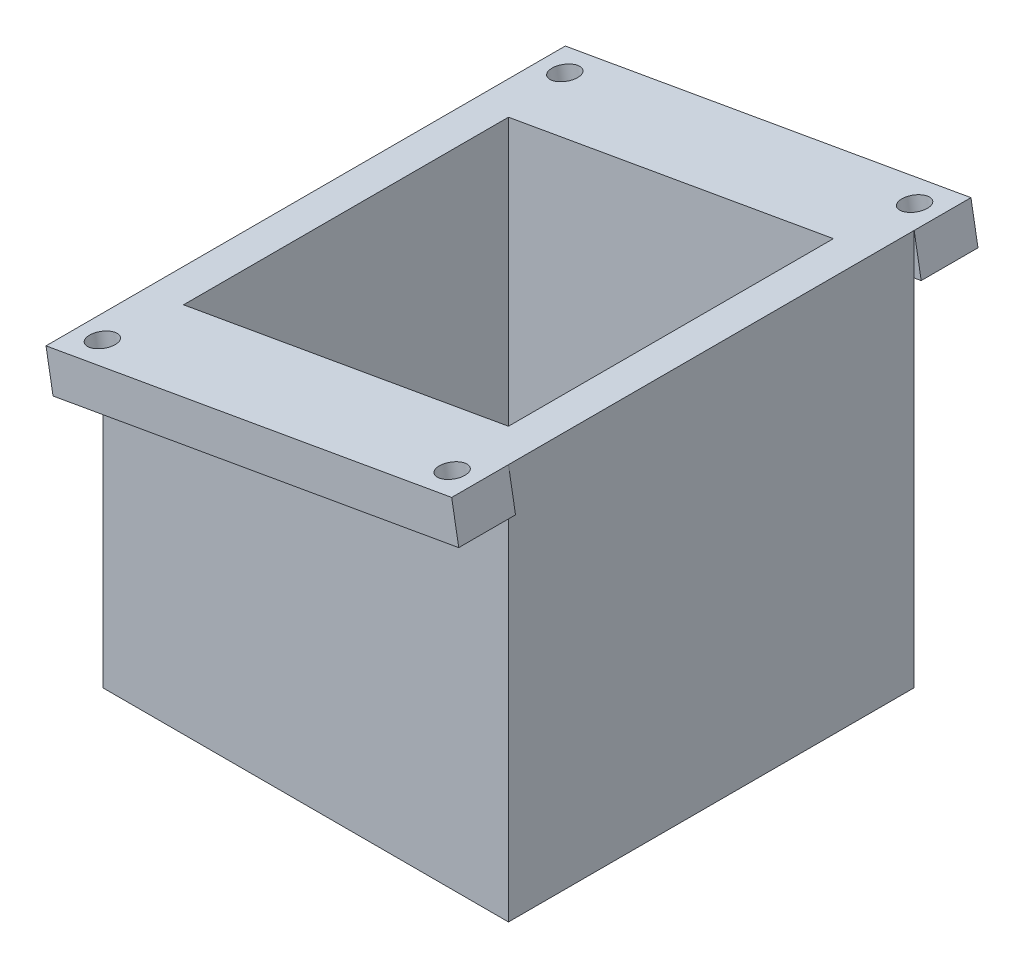
ISO-10303-21;
HEADER;
FILE_DESCRIPTION(('STEP AP214'),'2;1');
FILE_NAME('part.step','',(''),(''),'','','');
FILE_SCHEMA(('AUTOMOTIVE_DESIGN { 1 0 10303 214 1 1 1 1 }'));
ENDSEC;
DATA;
#1=APPLICATION_CONTEXT('core data for automotive mechanical design processes');
#2=APPLICATION_PROTOCOL_DEFINITION('international standard','automotive_design',2000,#1);
#3=PRODUCT_CONTEXT('',#1,'mechanical');
#4=PRODUCT('Part','Part','',(#3));
#5=PRODUCT_RELATED_PRODUCT_CATEGORY('part','',(#4));
#6=PRODUCT_DEFINITION_FORMATION('','',#4);
#7=PRODUCT_DEFINITION_CONTEXT('part definition',#1,'design');
#8=PRODUCT_DEFINITION('design','',#6,#7);
#9=PRODUCT_DEFINITION_SHAPE('','',#8);
#10=(LENGTH_UNIT() NAMED_UNIT(*) SI_UNIT(.MILLI.,.METRE.));
#11=(NAMED_UNIT(*) PLANE_ANGLE_UNIT() SI_UNIT($,.RADIAN.));
#12=(NAMED_UNIT(*) SI_UNIT($,.STERADIAN.) SOLID_ANGLE_UNIT());
#13=UNCERTAINTY_MEASURE_WITH_UNIT(LENGTH_MEASURE(1.E-05),#10,'distance_accuracy_value','');
#14=(GEOMETRIC_REPRESENTATION_CONTEXT(3) GLOBAL_UNCERTAINTY_ASSIGNED_CONTEXT((#13)) GLOBAL_UNIT_ASSIGNED_CONTEXT((#10,
#11,#12)) REPRESENTATION_CONTEXT('',''));
#15=CARTESIAN_POINT('',(0.,0.,0.));
#16=DIRECTION('',(0.,0.,1.));
#17=DIRECTION('',(1.,0.,0.));
#18=AXIS2_PLACEMENT_3D('',#15,#16,#17);
#19=CARTESIAN_POINT('',(25.,5.,-25.));
#20=DIRECTION('',(0.,0.,1.));
#21=DIRECTION('',(1.,0.,0.));
#22=AXIS2_PLACEMENT_3D('',#19,#20,#21);
#23=PLANE('',#22);
#24=DIRECTION('',(-0.17364819609251,0.984807749763281,0.));
#25=VECTOR('',#24,1.);
#26=CARTESIAN_POINT('',(-24.1317590195375,35.0759612511836,-25.));
#27=LINE('',#26,#25);
#28=CARTESIAN_POINT('',(-24.1317590195375,35.0759612511836,-25.));
#29=VERTEX_POINT('',#28);
#30=CARTESIAN_POINT('',(-25.,40.,-25.));
#31=VERTEX_POINT('',#30);
#32=EDGE_CURVE('E301',#29,#31,#27,.T.);
#33=ORIENTED_EDGE('',*,*,#32,.F.);
#34=DIRECTION('',(0.984807749763281,0.17364819609251,0.));
#35=VECTOR('',#34,1.);
#36=CARTESIAN_POINT('',(-24.1317590195375,35.0759612511836,-25.));
#37=LINE('',#36,#35);
#38=CARTESIAN_POINT('',(25.,43.7392169238216,-25.));
#39=VERTEX_POINT('',#38);
#40=EDGE_CURVE('E292',#29,#39,#37,.T.);
#41=ORIENTED_EDGE('',*,*,#40,.T.);
#42=DIRECTION('',(0.,-1.,0.));
#43=VECTOR('',#42,1.);
#44=CARTESIAN_POINT('',(25.,5.,-25.));
#45=LINE('',#44,#43);
#46=CARTESIAN_POINT('',(25.,0.,-25.));
#47=VERTEX_POINT('',#46);
#48=EDGE_CURVE('E285',#39,#47,#45,.T.);
#49=ORIENTED_EDGE('',*,*,#48,.T.);
#50=DIRECTION('',(-1.,0.,0.));
#51=VECTOR('',#50,1.);
#52=CARTESIAN_POINT('',(25.,0.,-25.));
#53=LINE('',#52,#51);
#54=CARTESIAN_POINT('',(-25.,0.,-25.));
#55=VERTEX_POINT('',#54);
#56=EDGE_CURVE('E280',#47,#55,#53,.T.);
#57=ORIENTED_EDGE('',*,*,#56,.T.);
#58=DIRECTION('',(0.,-1.,0.));
#59=VECTOR('',#58,1.);
#60=CARTESIAN_POINT('',(-25.,5.,-25.));
#61=LINE('',#60,#59);
#62=EDGE_CURVE('E282',#31,#55,#61,.T.);
#63=ORIENTED_EDGE('',*,*,#62,.F.);
#64=EDGE_LOOP('',(#33,#41,#49,#57,#63));
#65=FACE_BOUND('',#64,.T.);
#66=ADVANCED_FACE('F39',(#65),#23,.F.);
#67=CARTESIAN_POINT('',(0.,5.,0.));
#68=DIRECTION('',(0.,-1.,0.));
#69=DIRECTION('',(0.,0.,-1.));
#70=AXIS2_PLACEMENT_3D('',#67,#68,#69);
#71=PLANE('',#70);
#72=DIRECTION('',(0.,0.,-1.));
#73=VECTOR('',#72,1.);
#74=CARTESIAN_POINT('',(20.025,5.,0.));
#75=LINE('',#74,#73);
#76=CARTESIAN_POINT('',(20.025,5.,20.025));
#77=VERTEX_POINT('',#76);
#78=CARTESIAN_POINT('',(20.025,5.,-20.025));
#79=VERTEX_POINT('',#78);
#80=EDGE_CURVE('E235',#77,#79,#75,.T.);
#81=ORIENTED_EDGE('',*,*,#80,.T.);
#82=DIRECTION('',(-1.,0.,0.));
#83=VECTOR('',#82,1.);
#84=CARTESIAN_POINT('',(0.,5.,-20.025));
#85=LINE('',#84,#83);
#86=CARTESIAN_POINT('',(-20.025,5.,-20.025));
#87=VERTEX_POINT('',#86);
#88=EDGE_CURVE('E238',#79,#87,#85,.T.);
#89=ORIENTED_EDGE('',*,*,#88,.T.);
#90=DIRECTION('',(0.,0.,1.));
#91=VECTOR('',#90,1.);
#92=CARTESIAN_POINT('',(-20.025,5.,0.));
#93=LINE('',#92,#91);
#94=CARTESIAN_POINT('',(-20.025,5.,20.025));
#95=VERTEX_POINT('',#94);
#96=EDGE_CURVE('E229',#87,#95,#93,.T.);
#97=ORIENTED_EDGE('',*,*,#96,.T.);
#98=DIRECTION('',(1.,0.,0.));
#99=VECTOR('',#98,1.);
#100=CARTESIAN_POINT('',(0.,5.,20.025));
#101=LINE('',#100,#99);
#102=EDGE_CURVE('E232',#95,#77,#101,.T.);
#103=ORIENTED_EDGE('',*,*,#102,.T.);
#104=EDGE_LOOP('',(#81,#89,#97,#103));
#105=FACE_BOUND('',#104,.T.);
#106=DIRECTION('',(0.,0.,1.));
#107=VECTOR('',#106,1.);
#108=CARTESIAN_POINT('',(-18.025,5.,-18.025));
#109=LINE('',#108,#107);
#110=CARTESIAN_POINT('',(-18.025,5.,-18.025));
#111=VERTEX_POINT('',#110);
#112=CARTESIAN_POINT('',(-18.025,5.,18.025));
#113=VERTEX_POINT('',#112);
#114=EDGE_CURVE('E242',#111,#113,#109,.T.);
#115=ORIENTED_EDGE('',*,*,#114,.F.);
#116=DIRECTION('',(-1.,0.,0.));
#117=VECTOR('',#116,1.);
#118=CARTESIAN_POINT('',(18.025,5.,-18.025));
#119=LINE('',#118,#117);
#120=CARTESIAN_POINT('',(18.025,5.,-18.025));
#121=VERTEX_POINT('',#120);
#122=EDGE_CURVE('E250',#121,#111,#119,.T.);
#123=ORIENTED_EDGE('',*,*,#122,.F.);
#124=DIRECTION('',(0.,0.,-1.));
#125=VECTOR('',#124,1.);
#126=CARTESIAN_POINT('',(18.025,5.,-18.025));
#127=LINE('',#126,#125);
#128=CARTESIAN_POINT('',(18.025,5.,18.025));
#129=VERTEX_POINT('',#128);
#130=EDGE_CURVE('E247',#129,#121,#127,.T.);
#131=ORIENTED_EDGE('',*,*,#130,.F.);
#132=DIRECTION('',(1.,0.,0.));
#133=VECTOR('',#132,1.);
#134=CARTESIAN_POINT('',(18.025,5.,18.025));
#135=LINE('',#134,#133);
#136=EDGE_CURVE('E244',#113,#129,#135,.T.);
#137=ORIENTED_EDGE('',*,*,#136,.F.);
#138=EDGE_LOOP('',(#115,#123,#131,#137));
#139=FACE_BOUND('',#138,.T.);
#140=ADVANCED_FACE('F332',(#105,#139),#71,.F.);
#141=CARTESIAN_POINT('',(0.,0.,0.));
#142=DIRECTION('',(0.,-1.,0.));
#143=DIRECTION('',(0.,0.,-1.));
#144=AXIS2_PLACEMENT_3D('',#141,#142,#143);
#145=PLANE('',#144);
#146=DIRECTION('',(-1.,0.,0.));
#147=VECTOR('',#146,1.);
#148=CARTESIAN_POINT('',(18.025,0.,-18.025));
#149=LINE('',#148,#147);
#150=CARTESIAN_POINT('',(18.025,0.,-18.025));
#151=VERTEX_POINT('',#150);
#152=CARTESIAN_POINT('',(-18.025,0.,-18.025));
#153=VERTEX_POINT('',#152);
#154=EDGE_CURVE('E245',#151,#153,#149,.T.);
#155=ORIENTED_EDGE('',*,*,#154,.T.);
#156=DIRECTION('',(0.,0.,1.));
#157=VECTOR('',#156,1.);
#158=CARTESIAN_POINT('',(-18.025,0.,-18.025));
#159=LINE('',#158,#157);
#160=CARTESIAN_POINT('',(-18.025,0.,18.025));
#161=VERTEX_POINT('',#160);
#162=EDGE_CURVE('E241',#153,#161,#159,.T.);
#163=ORIENTED_EDGE('',*,*,#162,.T.);
#164=DIRECTION('',(1.,0.,0.));
#165=VECTOR('',#164,1.);
#166=CARTESIAN_POINT('',(18.025,0.,18.025));
#167=LINE('',#166,#165);
#168=CARTESIAN_POINT('',(18.025,0.,18.025));
#169=VERTEX_POINT('',#168);
#170=EDGE_CURVE('E255',#161,#169,#167,.T.);
#171=ORIENTED_EDGE('',*,*,#170,.T.);
#172=DIRECTION('',(0.,0.,-1.));
#173=VECTOR('',#172,1.);
#174=CARTESIAN_POINT('',(18.025,0.,-18.025));
#175=LINE('',#174,#173);
#176=EDGE_CURVE('E258',#169,#151,#175,.T.);
#177=ORIENTED_EDGE('',*,*,#176,.T.);
#178=EDGE_LOOP('',(#155,#163,#171,#177));
#179=FACE_BOUND('',#178,.T.);
#180=DIRECTION('',(0.,0.,1.));
#181=VECTOR('',#180,1.);
#182=CARTESIAN_POINT('',(-25.,0.,-25.));
#183=LINE('',#182,#181);
#184=CARTESIAN_POINT('',(-25.,0.,25.));
#185=VERTEX_POINT('',#184);
#186=EDGE_CURVE('E272',#55,#185,#183,.T.);
#187=ORIENTED_EDGE('',*,*,#186,.F.);
#188=ORIENTED_EDGE('',*,*,#56,.F.);
#189=DIRECTION('',(0.,0.,-1.));
#190=VECTOR('',#189,1.);
#191=CARTESIAN_POINT('',(25.,0.,-25.));
#192=LINE('',#191,#190);
#193=CARTESIAN_POINT('',(25.,0.,25.));
#194=VERTEX_POINT('',#193);
#195=EDGE_CURVE('E278',#194,#47,#192,.T.);
#196=ORIENTED_EDGE('',*,*,#195,.F.);
#197=DIRECTION('',(1.,0.,0.));
#198=VECTOR('',#197,1.);
#199=CARTESIAN_POINT('',(25.,0.,25.));
#200=LINE('',#199,#198);
#201=EDGE_CURVE('E275',#185,#194,#200,.T.);
#202=ORIENTED_EDGE('',*,*,#201,.F.);
#203=EDGE_LOOP('',(#187,#188,#196,#202));
#204=FACE_BOUND('',#203,.T.);
#205=ADVANCED_FACE('F296',(#179,#204),#145,.T.);
#206=CARTESIAN_POINT('',(-25.,5.,-25.));
#207=DIRECTION('',(1.,0.,0.));
#208=DIRECTION('',(0.,0.,-1.));
#209=AXIS2_PLACEMENT_3D('',#206,#207,#208);
#210=PLANE('',#209);
#211=ORIENTED_EDGE('',*,*,#186,.T.);
#212=DIRECTION('',(0.,-1.,0.));
#213=VECTOR('',#212,1.);
#214=CARTESIAN_POINT('',(-25.,5.,25.));
#215=LINE('',#214,#213);
#216=CARTESIAN_POINT('',(-25.,40.,25.));
#217=VERTEX_POINT('',#216);
#218=EDGE_CURVE('E43',#217,#185,#215,.T.);
#219=ORIENTED_EDGE('',*,*,#218,.F.);
#220=DIRECTION('',(0.,0.,1.));
#221=VECTOR('',#220,1.);
#222=CARTESIAN_POINT('',(-25.,40.,25.));
#223=LINE('',#222,#221);
#224=EDGE_CURVE('E211',#31,#217,#223,.T.);
#225=ORIENTED_EDGE('',*,*,#224,.F.);
#226=ORIENTED_EDGE('',*,*,#62,.T.);
#227=EDGE_LOOP('',(#211,#219,#225,#226));
#228=FACE_BOUND('',#227,.T.);
#229=ADVANCED_FACE('F41',(#228),#210,.F.);
#230=CARTESIAN_POINT('',(25.,5.,25.));
#231=DIRECTION('',(0.,0.,-1.));
#232=DIRECTION('',(-1.,0.,0.));
#233=AXIS2_PLACEMENT_3D('',#230,#231,#232);
#234=PLANE('',#233);
#235=DIRECTION('',(0.,-1.,0.));
#236=VECTOR('',#235,1.);
#237=CARTESIAN_POINT('',(25.,5.,25.));
#238=LINE('',#237,#236);
#239=CARTESIAN_POINT('',(25.,43.7392169238216,25.));
#240=VERTEX_POINT('',#239);
#241=EDGE_CURVE('E180',#240,#194,#238,.T.);
#242=ORIENTED_EDGE('',*,*,#241,.F.);
#243=DIRECTION('',(-0.984807749763281,-0.17364819609251,0.));
#244=VECTOR('',#243,1.);
#245=CARTESIAN_POINT('',(-24.1317590195375,35.0759612511836,25.));
#246=LINE('',#245,#244);
#247=CARTESIAN_POINT('',(-24.1317590195375,35.0759612511836,25.));
#248=VERTEX_POINT('',#247);
#249=EDGE_CURVE('E11',#240,#248,#246,.T.);
#250=ORIENTED_EDGE('',*,*,#249,.T.);
#251=DIRECTION('',(-0.17364819609251,0.984807749763281,0.));
#252=VECTOR('',#251,1.);
#253=CARTESIAN_POINT('',(-24.1317590195375,35.0759612511836,25.));
#254=LINE('',#253,#252);
#255=EDGE_CURVE('E362',#248,#217,#254,.T.);
#256=ORIENTED_EDGE('',*,*,#255,.T.);
#257=ORIENTED_EDGE('',*,*,#218,.T.);
#258=ORIENTED_EDGE('',*,*,#201,.T.);
#259=EDGE_LOOP('',(#242,#250,#256,#257,#258));
#260=FACE_BOUND('',#259,.T.);
#261=ADVANCED_FACE('F355',(#260),#234,.F.);
#262=CARTESIAN_POINT('',(25.,5.,-25.));
#263=DIRECTION('',(-1.,0.,0.));
#264=DIRECTION('',(0.,0.,1.));
#265=AXIS2_PLACEMENT_3D('',#262,#263,#264);
#266=PLANE('',#265);
#267=ORIENTED_EDGE('',*,*,#195,.T.);
#268=ORIENTED_EDGE('',*,*,#48,.F.);
#269=CARTESIAN_POINT('',(25.,48.81635,-25.));
#270=VERTEX_POINT('',#269);
#271=EDGE_CURVE('E206',#270,#39,#45,.T.);
#272=ORIENTED_EDGE('',*,*,#271,.F.);
#273=DIRECTION('',(0.,0.,-1.));
#274=VECTOR('',#273,1.);
#275=CARTESIAN_POINT('',(25.,48.81635,25.));
#276=LINE('',#275,#274);
#277=CARTESIAN_POINT('',(25.,48.81635,25.));
#278=VERTEX_POINT('',#277);
#279=EDGE_CURVE('E197',#278,#270,#276,.T.);
#280=ORIENTED_EDGE('',*,*,#279,.F.);
#281=EDGE_CURVE('E172',#278,#240,#238,.T.);
#282=ORIENTED_EDGE('',*,*,#281,.T.);
#283=ORIENTED_EDGE('',*,*,#241,.T.);
#284=EDGE_LOOP('',(#267,#268,#272,#280,#282,#283));
#285=FACE_BOUND('',#284,.T.);
#286=ADVANCED_FACE('F204',(#285),#266,.F.);
#287=CARTESIAN_POINT('',(-18.025,5.,-18.025));
#288=DIRECTION('',(1.,0.,0.));
#289=DIRECTION('',(0.,0.,-1.));
#290=AXIS2_PLACEMENT_3D('',#287,#288,#289);
#291=PLANE('',#290);
#292=ORIENTED_EDGE('',*,*,#162,.F.);
#293=DIRECTION('',(0.,-1.,0.));
#294=VECTOR('',#293,1.);
#295=CARTESIAN_POINT('',(-18.025,5.,-18.025));
#296=LINE('',#295,#294);
#297=EDGE_CURVE('E252',#111,#153,#296,.T.);
#298=ORIENTED_EDGE('',*,*,#297,.F.);
#299=ORIENTED_EDGE('',*,*,#114,.T.);
#300=DIRECTION('',(0.,-1.,0.));
#301=VECTOR('',#300,1.);
#302=CARTESIAN_POINT('',(-18.025,5.,18.025));
#303=LINE('',#302,#301);
#304=EDGE_CURVE('E269',#113,#161,#303,.T.);
#305=ORIENTED_EDGE('',*,*,#304,.T.);
#306=EDGE_LOOP('',(#292,#298,#299,#305));
#307=FACE_BOUND('',#306,.T.);
#308=ADVANCED_FACE('F354',(#307),#291,.T.);
#309=CARTESIAN_POINT('',(18.025,5.,18.025));
#310=DIRECTION('',(0.,0.,-1.));
#311=DIRECTION('',(-1.,0.,0.));
#312=AXIS2_PLACEMENT_3D('',#309,#310,#311);
#313=PLANE('',#312);
#314=ORIENTED_EDGE('',*,*,#170,.F.);
#315=ORIENTED_EDGE('',*,*,#304,.F.);
#316=ORIENTED_EDGE('',*,*,#136,.T.);
#317=DIRECTION('',(0.,-1.,0.));
#318=VECTOR('',#317,1.);
#319=CARTESIAN_POINT('',(18.025,5.,18.025));
#320=LINE('',#319,#318);
#321=EDGE_CURVE('E267',#129,#169,#320,.T.);
#322=ORIENTED_EDGE('',*,*,#321,.T.);
#323=EDGE_LOOP('',(#314,#315,#316,#322));
#324=FACE_BOUND('',#323,.T.);
#325=ADVANCED_FACE('F644',(#324),#313,.T.);
#326=CARTESIAN_POINT('',(18.025,5.,-18.025));
#327=DIRECTION('',(-1.,0.,0.));
#328=DIRECTION('',(0.,0.,1.));
#329=AXIS2_PLACEMENT_3D('',#326,#327,#328);
#330=PLANE('',#329);
#331=ORIENTED_EDGE('',*,*,#176,.F.);
#332=ORIENTED_EDGE('',*,*,#321,.F.);
#333=ORIENTED_EDGE('',*,*,#130,.T.);
#334=DIRECTION('',(0.,-1.,0.));
#335=VECTOR('',#334,1.);
#336=CARTESIAN_POINT('',(18.025,5.,-18.025));
#337=LINE('',#336,#335);
#338=EDGE_CURVE('E265',#121,#151,#337,.T.);
#339=ORIENTED_EDGE('',*,*,#338,.T.);
#340=EDGE_LOOP('',(#331,#332,#333,#339));
#341=FACE_BOUND('',#340,.T.);
#342=ADVANCED_FACE('F633',(#341),#330,.T.);
#343=CARTESIAN_POINT('',(18.025,5.,-18.025));
#344=DIRECTION('',(0.,0.,1.));
#345=DIRECTION('',(1.,0.,0.));
#346=AXIS2_PLACEMENT_3D('',#343,#344,#345);
#347=PLANE('',#346);
#348=ORIENTED_EDGE('',*,*,#154,.F.);
#349=ORIENTED_EDGE('',*,*,#338,.F.);
#350=ORIENTED_EDGE('',*,*,#122,.T.);
#351=ORIENTED_EDGE('',*,*,#297,.T.);
#352=EDGE_LOOP('',(#348,#349,#350,#351));
#353=FACE_BOUND('',#352,.T.);
#354=ADVANCED_FACE('F343',(#353),#347,.T.);
#355=CARTESIAN_POINT('',(20.025,110.710678118655,-20.025));
#356=DIRECTION('',(0.,0.,1.));
#357=DIRECTION('',(1.,0.,0.));
#358=AXIS2_PLACEMENT_3D('',#355,#356,#357);
#359=PLANE('',#358);
#360=ORIENTED_EDGE('',*,*,#88,.F.);
#361=DIRECTION('',(0.,-1.,0.));
#362=VECTOR('',#361,1.);
#363=CARTESIAN_POINT('',(20.025,110.710678118655,-20.025));
#364=LINE('',#363,#362);
#365=CARTESIAN_POINT('',(20.025,47.939123175,-20.025));
#366=VERTEX_POINT('',#365);
#367=EDGE_CURVE('E222',#366,#79,#364,.T.);
#368=ORIENTED_EDGE('',*,*,#367,.F.);
#369=DIRECTION('',(-0.984807749763281,-0.17364819609251,0.));
#370=VECTOR('',#369,1.);
#371=CARTESIAN_POINT('',(31.6066827751661,49.9812865536967,-20.025));
#372=LINE('',#371,#370);
#373=CARTESIAN_POINT('',(-20.025,40.877226825,-20.025));
#374=VERTEX_POINT('',#373);
#375=EDGE_CURVE('E207',#366,#374,#372,.T.);
#376=ORIENTED_EDGE('',*,*,#375,.T.);
#377=DIRECTION('',(0.,-1.,0.));
#378=VECTOR('',#377,1.);
#379=CARTESIAN_POINT('',(-20.025,110.710678118655,-20.025));
#380=LINE('',#379,#378);
#381=EDGE_CURVE('E219',#374,#87,#380,.T.);
#382=ORIENTED_EDGE('',*,*,#381,.T.);
#383=EDGE_LOOP('',(#360,#368,#376,#382));
#384=FACE_BOUND('',#383,.T.);
#385=ADVANCED_FACE('F330',(#384),#359,.T.);
#386=CARTESIAN_POINT('',(20.025,110.710678118655,20.025));
#387=DIRECTION('',(-1.,0.,0.));
#388=DIRECTION('',(0.,0.,1.));
#389=AXIS2_PLACEMENT_3D('',#386,#387,#388);
#390=PLANE('',#389);
#391=ORIENTED_EDGE('',*,*,#80,.F.);
#392=DIRECTION('',(0.,-1.,0.));
#393=VECTOR('',#392,1.);
#394=CARTESIAN_POINT('',(20.025,110.710678118655,20.025));
#395=LINE('',#394,#393);
#396=CARTESIAN_POINT('',(20.025,47.939123175,20.025));
#397=VERTEX_POINT('',#396);
#398=EDGE_CURVE('E225',#397,#77,#395,.T.);
#399=ORIENTED_EDGE('',*,*,#398,.F.);
#400=DIRECTION('',(0.,0.,-1.));
#401=VECTOR('',#400,1.);
#402=CARTESIAN_POINT('',(20.025,47.939123175,20.025));
#403=LINE('',#402,#401);
#404=EDGE_CURVE('E306',#397,#366,#403,.T.);
#405=ORIENTED_EDGE('',*,*,#404,.T.);
#406=ORIENTED_EDGE('',*,*,#367,.T.);
#407=EDGE_LOOP('',(#391,#399,#405,#406));
#408=FACE_BOUND('',#407,.T.);
#409=ADVANCED_FACE('F335',(#408),#390,.T.);
#410=CARTESIAN_POINT('',(20.025,110.710678118655,20.025));
#411=DIRECTION('',(0.,0.,-1.));
#412=DIRECTION('',(-1.,0.,0.));
#413=AXIS2_PLACEMENT_3D('',#410,#411,#412);
#414=PLANE('',#413);
#415=ORIENTED_EDGE('',*,*,#102,.F.);
#416=DIRECTION('',(0.,-1.,0.));
#417=VECTOR('',#416,1.);
#418=CARTESIAN_POINT('',(-20.025,110.710678118655,20.025));
#419=LINE('',#418,#417);
#420=CARTESIAN_POINT('',(-20.025,40.877226825,20.025));
#421=VERTEX_POINT('',#420);
#422=EDGE_CURVE('E64',#421,#95,#419,.T.);
#423=ORIENTED_EDGE('',*,*,#422,.F.);
#424=DIRECTION('',(0.984807749763281,0.17364819609251,0.));
#425=VECTOR('',#424,1.);
#426=CARTESIAN_POINT('',(31.6066827751661,49.9812865536967,20.025));
#427=LINE('',#426,#425);
#428=EDGE_CURVE('E213',#421,#397,#427,.T.);
#429=ORIENTED_EDGE('',*,*,#428,.T.);
#430=ORIENTED_EDGE('',*,*,#398,.T.);
#431=EDGE_LOOP('',(#415,#423,#429,#430));
#432=FACE_BOUND('',#431,.T.);
#433=ADVANCED_FACE('F323',(#432),#414,.T.);
#434=CARTESIAN_POINT('',(-20.025,110.710678118655,20.025));
#435=DIRECTION('',(1.,0.,0.));
#436=DIRECTION('',(0.,0.,-1.));
#437=AXIS2_PLACEMENT_3D('',#434,#435,#436);
#438=PLANE('',#437);
#439=ORIENTED_EDGE('',*,*,#96,.F.);
#440=ORIENTED_EDGE('',*,*,#381,.F.);
#441=DIRECTION('',(0.,0.,1.));
#442=VECTOR('',#441,1.);
#443=CARTESIAN_POINT('',(-20.025,40.877226825,20.025));
#444=LINE('',#443,#442);
#445=EDGE_CURVE('E208',#374,#421,#444,.T.);
#446=ORIENTED_EDGE('',*,*,#445,.T.);
#447=ORIENTED_EDGE('',*,*,#422,.T.);
#448=EDGE_LOOP('',(#439,#440,#446,#447));
#449=FACE_BOUND('',#448,.T.);
#450=ADVANCED_FACE('F328',(#449),#438,.T.);
#451=CARTESIAN_POINT('',(-7.59424596992729,43.0691043908606,0.));
#452=DIRECTION('',(-0.17364819609251,0.984807749763281,0.));
#453=DIRECTION('',(-0.984807749763281,-0.17364819609251,0.));
#454=AXIS2_PLACEMENT_3D('',#451,#452,#453);
#455=PLANE('',#454);
#456=CARTESIAN_POINT('',(-21.5531728758285,40.6077686863238,-28.5));
#457=DIRECTION('',(-0.17364819609251,0.984807749763281,0.));
#458=DIRECTION('',(0.984807749763281,0.17364819609251,0.));
#459=AXIS2_PLACEMENT_3D('',#456,#457,#458);
#460=CIRCLE('',#459,1.60000000000001);
#461=CARTESIAN_POINT('',(-19.9774804762073,40.8856058000718,-28.5));
#462=VERTEX_POINT('',#461);
#463=EDGE_CURVE('E428',#462,#462,#460,.T.);
#464=ORIENTED_EDGE('',*,*,#463,.F.);
#465=EDGE_LOOP('',(#464));
#466=FACE_BOUND('',#465,.T.);
#467=CARTESIAN_POINT('',(21.5531728758285,48.2085813136762,-28.5));
#468=DIRECTION('',(-0.17364819609251,0.984807749763281,0.));
#469=DIRECTION('',(-0.984807749763281,-0.17364819609251,0.));
#470=AXIS2_PLACEMENT_3D('',#467,#468,#469);
#471=CIRCLE('',#470,1.6);
#472=CARTESIAN_POINT('',(19.9774804762073,47.9307441999282,-28.5));
#473=VERTEX_POINT('',#472);
#474=EDGE_CURVE('E432',#473,#473,#471,.T.);
#475=ORIENTED_EDGE('',*,*,#474,.F.);
#476=EDGE_LOOP('',(#475));
#477=FACE_BOUND('',#476,.T.);
#478=CARTESIAN_POINT('',(21.5531728758285,48.2085813136762,28.5));
#479=DIRECTION('',(-0.17364819609251,0.984807749763281,0.));
#480=DIRECTION('',(0.984807749763281,0.17364819609251,0.));
#481=AXIS2_PLACEMENT_3D('',#478,#479,#480);
#482=CIRCLE('',#481,1.6);
#483=CARTESIAN_POINT('',(23.1288652754497,48.4864184274242,28.5));
#484=VERTEX_POINT('',#483);
#485=EDGE_CURVE('E436',#484,#484,#482,.T.);
#486=ORIENTED_EDGE('',*,*,#485,.F.);
#487=EDGE_LOOP('',(#486));
#488=FACE_BOUND('',#487,.T.);
#489=CARTESIAN_POINT('',(-21.5531728758285,40.6077686863238,28.5));
#490=DIRECTION('',(-0.17364819609251,0.984807749763281,0.));
#491=DIRECTION('',(-0.984807749763281,-0.17364819609251,0.));
#492=AXIS2_PLACEMENT_3D('',#489,#490,#491);
#493=CIRCLE('',#492,1.60000000000001);
#494=CARTESIAN_POINT('',(-23.1288652754498,40.3299315725758,28.5));
#495=VERTEX_POINT('',#494);
#496=EDGE_CURVE('E372',#495,#495,#493,.T.);
#497=ORIENTED_EDGE('',*,*,#496,.F.);
#498=EDGE_LOOP('',(#497));
#499=FACE_BOUND('',#498,.T.);
#500=ORIENTED_EDGE('',*,*,#445,.F.);
#501=ORIENTED_EDGE('',*,*,#375,.F.);
#502=ORIENTED_EDGE('',*,*,#404,.F.);
#503=ORIENTED_EDGE('',*,*,#428,.F.);
#504=EDGE_LOOP('',(#500,#501,#502,#503));
#505=FACE_BOUND('',#504,.T.);
#506=ORIENTED_EDGE('',*,*,#279,.T.);
#507=DIRECTION('',(0.,0.,-1.));
#508=VECTOR('',#507,1.);
#509=CARTESIAN_POINT('',(25.,48.81635,-25.));
#510=LINE('',#509,#508);
#511=CARTESIAN_POINT('',(25.,48.81635,-32.));
#512=VERTEX_POINT('',#511);
#513=EDGE_CURVE('E378',#270,#512,#510,.T.);
#514=ORIENTED_EDGE('',*,*,#513,.T.);
#515=DIRECTION('',(-0.984807749763281,-0.17364819609251,0.));
#516=VECTOR('',#515,1.);
#517=CARTESIAN_POINT('',(-25.,40.,-32.));
#518=LINE('',#517,#516);
#519=CARTESIAN_POINT('',(-25.,40.,-32.));
#520=VERTEX_POINT('',#519);
#521=EDGE_CURVE('E392',#512,#520,#518,.T.);
#522=ORIENTED_EDGE('',*,*,#521,.T.);
#523=DIRECTION('',(0.,0.,1.));
#524=VECTOR('',#523,1.);
#525=CARTESIAN_POINT('',(-25.,40.,-25.));
#526=LINE('',#525,#524);
#527=EDGE_CURVE('E314',#520,#31,#526,.T.);
#528=ORIENTED_EDGE('',*,*,#527,.T.);
#529=ORIENTED_EDGE('',*,*,#224,.T.);
#530=DIRECTION('',(0.,0.,1.));
#531=VECTOR('',#530,1.);
#532=CARTESIAN_POINT('',(-25.,40.,25.));
#533=LINE('',#532,#531);
#534=CARTESIAN_POINT('',(-25.,40.,32.));
#535=VERTEX_POINT('',#534);
#536=EDGE_CURVE('E377',#217,#535,#533,.T.);
#537=ORIENTED_EDGE('',*,*,#536,.T.);
#538=DIRECTION('',(0.984807749763281,0.17364819609251,0.));
#539=VECTOR('',#538,1.);
#540=CARTESIAN_POINT('',(-25.,40.,32.));
#541=LINE('',#540,#539);
#542=CARTESIAN_POINT('',(25.,48.81635,32.));
#543=VERTEX_POINT('',#542);
#544=EDGE_CURVE('E200',#535,#543,#541,.T.);
#545=ORIENTED_EDGE('',*,*,#544,.T.);
#546=DIRECTION('',(0.,0.,-1.));
#547=VECTOR('',#546,1.);
#548=CARTESIAN_POINT('',(25.,48.81635,25.));
#549=LINE('',#548,#547);
#550=EDGE_CURVE('E186',#543,#278,#549,.T.);
#551=ORIENTED_EDGE('',*,*,#550,.T.);
#552=EDGE_LOOP('',(#506,#514,#522,#528,#529,#537,#545,#551));
#553=FACE_BOUND('',#552,.T.);
#554=ADVANCED_FACE('F195',(#466,#477,#488,#499,#505,#553),#455,.T.);
#555=CARTESIAN_POINT('',(-24.1317590195375,35.0759612511836,-25.));
#556=DIRECTION('',(0.,0.,1.));
#557=DIRECTION('',(1.,0.,0.));
#558=AXIS2_PLACEMENT_3D('',#555,#556,#557);
#559=PLANE('',#558);
#560=DIRECTION('',(-0.17364819609251,0.984807749763281,0.));
#561=VECTOR('',#560,1.);
#562=CARTESIAN_POINT('',(25.8682409804625,43.8923112511836,-25.));
#563=LINE('',#562,#561);
#564=CARTESIAN_POINT('',(25.8682409804625,43.8923112511836,-25.));
#565=VERTEX_POINT('',#564);
#566=EDGE_CURVE('E318',#565,#270,#563,.T.);
#567=ORIENTED_EDGE('',*,*,#566,.T.);
#568=ORIENTED_EDGE('',*,*,#271,.T.);
#569=EDGE_CURVE('E56',#39,#565,#37,.T.);
#570=ORIENTED_EDGE('',*,*,#569,.T.);
#571=EDGE_LOOP('',(#567,#568,#570));
#572=FACE_BOUND('',#571,.T.);
#573=ADVANCED_FACE('F396',(#572),#559,.T.);
#574=CARTESIAN_POINT('',(-24.1317590195375,35.0759612511836,-25.));
#575=DIRECTION('',(-0.984807749763281,-0.17364819609251,0.));
#576=DIRECTION('',(0.17364819609251,-0.984807749763281,0.));
#577=AXIS2_PLACEMENT_3D('',#574,#575,#576);
#578=PLANE('',#577);
#579=ORIENTED_EDGE('',*,*,#527,.F.);
#580=DIRECTION('',(-0.17364819609251,0.984807749763281,0.));
#581=VECTOR('',#580,1.);
#582=CARTESIAN_POINT('',(-24.1317590195375,35.0759612511836,-32.));
#583=LINE('',#582,#581);
#584=CARTESIAN_POINT('',(-24.1317590195375,35.0759612511836,-32.));
#585=VERTEX_POINT('',#584);
#586=EDGE_CURVE('E307',#585,#520,#583,.T.);
#587=ORIENTED_EDGE('',*,*,#586,.F.);
#588=DIRECTION('',(0.,0.,1.));
#589=VECTOR('',#588,1.);
#590=CARTESIAN_POINT('',(-24.1317590195375,35.0759612511836,-25.));
#591=LINE('',#590,#589);
#592=EDGE_CURVE('E319',#585,#29,#591,.T.);
#593=ORIENTED_EDGE('',*,*,#592,.T.);
#594=ORIENTED_EDGE('',*,*,#32,.T.);
#595=EDGE_LOOP('',(#579,#587,#593,#594));
#596=FACE_BOUND('',#595,.T.);
#597=ADVANCED_FACE('F405',(#596),#578,.T.);
#598=CARTESIAN_POINT('',(-24.1317590195375,35.0759612511836,-32.));
#599=DIRECTION('',(0.,0.,-1.));
#600=DIRECTION('',(0.,1.,0.));
#601=AXIS2_PLACEMENT_3D('',#598,#599,#600);
#602=PLANE('',#601);
#603=ORIENTED_EDGE('',*,*,#521,.F.);
#604=DIRECTION('',(-0.17364819609251,0.984807749763281,0.));
#605=VECTOR('',#604,1.);
#606=CARTESIAN_POINT('',(25.8682409804625,43.8923112511836,-32.));
#607=LINE('',#606,#605);
#608=CARTESIAN_POINT('',(25.8682409804625,43.8923112511836,-32.));
#609=VERTEX_POINT('',#608);
#610=EDGE_CURVE('E311',#609,#512,#607,.T.);
#611=ORIENTED_EDGE('',*,*,#610,.F.);
#612=DIRECTION('',(-0.984807749763281,-0.17364819609251,0.));
#613=VECTOR('',#612,1.);
#614=CARTESIAN_POINT('',(-24.1317590195375,35.0759612511836,-32.));
#615=LINE('',#614,#613);
#616=EDGE_CURVE('E388',#609,#585,#615,.T.);
#617=ORIENTED_EDGE('',*,*,#616,.T.);
#618=ORIENTED_EDGE('',*,*,#586,.T.);
#619=EDGE_LOOP('',(#603,#611,#617,#618));
#620=FACE_BOUND('',#619,.T.);
#621=ADVANCED_FACE('F404',(#620),#602,.T.);
#622=CARTESIAN_POINT('',(25.8682409804625,43.8923112511836,-25.));
#623=DIRECTION('',(0.984807749763281,0.17364819609251,0.));
#624=DIRECTION('',(-0.17364819609251,0.984807749763281,0.));
#625=AXIS2_PLACEMENT_3D('',#622,#623,#624);
#626=PLANE('',#625);
#627=ORIENTED_EDGE('',*,*,#513,.F.);
#628=ORIENTED_EDGE('',*,*,#566,.F.);
#629=DIRECTION('',(0.,0.,-1.));
#630=VECTOR('',#629,1.);
#631=CARTESIAN_POINT('',(25.8682409804625,43.8923112511836,-25.));
#632=LINE('',#631,#630);
#633=EDGE_CURVE('E385',#565,#609,#632,.T.);
#634=ORIENTED_EDGE('',*,*,#633,.T.);
#635=ORIENTED_EDGE('',*,*,#610,.T.);
#636=EDGE_LOOP('',(#627,#628,#634,#635));
#637=FACE_BOUND('',#636,.T.);
#638=ADVANCED_FACE('F399',(#637),#626,.T.);
#639=CARTESIAN_POINT('',(-6.72600498946473,38.1450656420443,0.));
#640=DIRECTION('',(-0.17364819609251,0.984807749763281,0.));
#641=DIRECTION('',(-0.984807749763281,-0.17364819609251,0.));
#642=AXIS2_PLACEMENT_3D('',#639,#640,#641);
#643=PLANE('',#642);
#644=CARTESIAN_POINT('',(-20.684931895366,35.6837299375074,-28.5));
#645=DIRECTION('',(-0.17364819609251,0.984807749763281,0.));
#646=DIRECTION('',(0.984807749763281,0.17364819609251,0.));
#647=AXIS2_PLACEMENT_3D('',#644,#645,#646);
#648=CIRCLE('',#647,1.60000000000001);
#649=CARTESIAN_POINT('',(-19.1092394957447,35.9615670512554,-28.5));
#650=VERTEX_POINT('',#649);
#651=EDGE_CURVE('E452',#650,#650,#648,.T.);
#652=ORIENTED_EDGE('',*,*,#651,.T.);
#653=EDGE_LOOP('',(#652));
#654=FACE_BOUND('',#653,.T.);
#655=CARTESIAN_POINT('',(22.421413856291,43.2845425648598,-28.5));
#656=DIRECTION('',(-0.17364819609251,0.984807749763281,0.));
#657=DIRECTION('',(-0.984807749763281,-0.17364819609251,0.));
#658=AXIS2_PLACEMENT_3D('',#655,#656,#657);
#659=CIRCLE('',#658,1.6);
#660=CARTESIAN_POINT('',(20.8457214566698,43.0067054511118,-28.5));
#661=VERTEX_POINT('',#660);
#662=EDGE_CURVE('E448',#661,#661,#659,.T.);
#663=ORIENTED_EDGE('',*,*,#662,.T.);
#664=EDGE_LOOP('',(#663));
#665=FACE_BOUND('',#664,.T.);
#666=ORIENTED_EDGE('',*,*,#40,.F.);
#667=ORIENTED_EDGE('',*,*,#592,.F.);
#668=ORIENTED_EDGE('',*,*,#616,.F.);
#669=ORIENTED_EDGE('',*,*,#633,.F.);
#670=ORIENTED_EDGE('',*,*,#569,.F.);
#671=EDGE_LOOP('',(#666,#667,#668,#669,#670));
#672=FACE_BOUND('',#671,.T.);
#673=ADVANCED_FACE('F401',(#654,#665,#672),#643,.F.);
#674=CARTESIAN_POINT('',(-24.1317590195375,35.0759612511836,25.));
#675=DIRECTION('',(0.,0.,-1.));
#676=DIRECTION('',(0.,1.,0.));
#677=AXIS2_PLACEMENT_3D('',#674,#675,#676);
#678=PLANE('',#677);
#679=ORIENTED_EDGE('',*,*,#281,.F.);
#680=DIRECTION('',(-0.17364819609251,0.984807749763281,0.));
#681=VECTOR('',#680,1.);
#682=CARTESIAN_POINT('',(25.8682409804625,43.8923112511836,25.));
#683=LINE('',#682,#681);
#684=CARTESIAN_POINT('',(25.8682409804625,43.8923112511836,25.));
#685=VERTEX_POINT('',#684);
#686=EDGE_CURVE('E175',#685,#278,#683,.T.);
#687=ORIENTED_EDGE('',*,*,#686,.F.);
#688=EDGE_CURVE('E49',#685,#240,#246,.T.);
#689=ORIENTED_EDGE('',*,*,#688,.T.);
#690=EDGE_LOOP('',(#679,#687,#689));
#691=FACE_BOUND('',#690,.T.);
#692=ADVANCED_FACE('F174',(#691),#678,.T.);
#693=CARTESIAN_POINT('',(25.8682409804625,43.8923112511836,25.));
#694=DIRECTION('',(0.984807749763281,0.17364819609251,0.));
#695=DIRECTION('',(-0.17364819609251,0.984807749763281,0.));
#696=AXIS2_PLACEMENT_3D('',#693,#694,#695);
#697=PLANE('',#696);
#698=ORIENTED_EDGE('',*,*,#550,.F.);
#699=DIRECTION('',(-0.17364819609251,0.984807749763281,0.));
#700=VECTOR('',#699,1.);
#701=CARTESIAN_POINT('',(25.8682409804625,43.8923112511836,32.));
#702=LINE('',#701,#700);
#703=CARTESIAN_POINT('',(25.8682409804625,43.8923112511836,32.));
#704=VERTEX_POINT('',#703);
#705=EDGE_CURVE('E189',#704,#543,#702,.T.);
#706=ORIENTED_EDGE('',*,*,#705,.F.);
#707=DIRECTION('',(0.,0.,-1.));
#708=VECTOR('',#707,1.);
#709=CARTESIAN_POINT('',(25.8682409804625,43.8923112511836,25.));
#710=LINE('',#709,#708);
#711=EDGE_CURVE('E188',#704,#685,#710,.T.);
#712=ORIENTED_EDGE('',*,*,#711,.T.);
#713=ORIENTED_EDGE('',*,*,#686,.T.);
#714=EDGE_LOOP('',(#698,#706,#712,#713));
#715=FACE_BOUND('',#714,.T.);
#716=ADVANCED_FACE('F185',(#715),#697,.T.);
#717=CARTESIAN_POINT('',(-24.1317590195375,35.0759612511836,32.));
#718=DIRECTION('',(0.,0.,1.));
#719=DIRECTION('',(1.,0.,0.));
#720=AXIS2_PLACEMENT_3D('',#717,#718,#719);
#721=PLANE('',#720);
#722=ORIENTED_EDGE('',*,*,#544,.F.);
#723=DIRECTION('',(-0.17364819609251,0.984807749763281,0.));
#724=VECTOR('',#723,1.);
#725=CARTESIAN_POINT('',(-24.1317590195375,35.0759612511836,32.));
#726=LINE('',#725,#724);
#727=CARTESIAN_POINT('',(-24.1317590195375,35.0759612511836,32.));
#728=VERTEX_POINT('',#727);
#729=EDGE_CURVE('E366',#728,#535,#726,.T.);
#730=ORIENTED_EDGE('',*,*,#729,.F.);
#731=DIRECTION('',(0.984807749763281,0.17364819609251,0.));
#732=VECTOR('',#731,1.);
#733=CARTESIAN_POINT('',(-24.1317590195375,35.0759612511836,32.));
#734=LINE('',#733,#732);
#735=EDGE_CURVE('E368',#728,#704,#734,.T.);
#736=ORIENTED_EDGE('',*,*,#735,.T.);
#737=ORIENTED_EDGE('',*,*,#705,.T.);
#738=EDGE_LOOP('',(#722,#730,#736,#737));
#739=FACE_BOUND('',#738,.T.);
#740=ADVANCED_FACE('F481',(#739),#721,.T.);
#741=CARTESIAN_POINT('',(-24.1317590195375,35.0759612511836,25.));
#742=DIRECTION('',(-0.984807749763281,-0.17364819609251,0.));
#743=DIRECTION('',(0.17364819609251,-0.984807749763281,0.));
#744=AXIS2_PLACEMENT_3D('',#741,#742,#743);
#745=PLANE('',#744);
#746=ORIENTED_EDGE('',*,*,#536,.F.);
#747=ORIENTED_EDGE('',*,*,#255,.F.);
#748=DIRECTION('',(0.,0.,1.));
#749=VECTOR('',#748,1.);
#750=CARTESIAN_POINT('',(-24.1317590195375,35.0759612511836,25.));
#751=LINE('',#750,#749);
#752=EDGE_CURVE('E382',#248,#728,#751,.T.);
#753=ORIENTED_EDGE('',*,*,#752,.T.);
#754=ORIENTED_EDGE('',*,*,#729,.T.);
#755=EDGE_LOOP('',(#746,#747,#753,#754));
#756=FACE_BOUND('',#755,.T.);
#757=ADVANCED_FACE('F478',(#756),#745,.T.);
#758=CARTESIAN_POINT('',(-6.72600498946474,38.1450656420443,0.));
#759=DIRECTION('',(0.17364819609251,-0.984807749763281,0.));
#760=DIRECTION('',(0.984807749763281,0.17364819609251,0.));
#761=AXIS2_PLACEMENT_3D('',#758,#759,#760);
#762=PLANE('',#761);
#763=CARTESIAN_POINT('',(22.421413856291,43.2845425648598,28.5));
#764=DIRECTION('',(-0.17364819609251,0.984807749763281,0.));
#765=DIRECTION('',(0.984807749763281,0.17364819609251,0.));
#766=AXIS2_PLACEMENT_3D('',#763,#764,#765);
#767=CIRCLE('',#766,1.6);
#768=CARTESIAN_POINT('',(23.9971062559123,43.5623796786078,28.5));
#769=VERTEX_POINT('',#768);
#770=EDGE_CURVE('E441',#769,#769,#767,.T.);
#771=ORIENTED_EDGE('',*,*,#770,.T.);
#772=EDGE_LOOP('',(#771));
#773=FACE_BOUND('',#772,.T.);
#774=CARTESIAN_POINT('',(-20.684931895366,35.6837299375074,28.5));
#775=DIRECTION('',(-0.17364819609251,0.984807749763281,0.));
#776=DIRECTION('',(-0.984807749763281,-0.17364819609251,0.));
#777=AXIS2_PLACEMENT_3D('',#774,#775,#776);
#778=CIRCLE('',#777,1.60000000000001);
#779=CARTESIAN_POINT('',(-22.2606242949872,35.4058928237594,28.5));
#780=VERTEX_POINT('',#779);
#781=EDGE_CURVE('E190',#780,#780,#778,.T.);
#782=ORIENTED_EDGE('',*,*,#781,.T.);
#783=EDGE_LOOP('',(#782));
#784=FACE_BOUND('',#783,.T.);
#785=ORIENTED_EDGE('',*,*,#688,.F.);
#786=ORIENTED_EDGE('',*,*,#711,.F.);
#787=ORIENTED_EDGE('',*,*,#735,.F.);
#788=ORIENTED_EDGE('',*,*,#752,.F.);
#789=ORIENTED_EDGE('',*,*,#249,.F.);
#790=EDGE_LOOP('',(#785,#786,#787,#788,#789));
#791=FACE_BOUND('',#790,.T.);
#792=ADVANCED_FACE('F474',(#773,#784,#791),#762,.T.);
#793=CARTESIAN_POINT('',(-20.684931895366,35.6837299375074,28.5));
#794=DIRECTION('',(-0.17364819609251,0.984807749763281,0.));
#795=DIRECTION('',(-0.984807749763281,-0.17364819609251,0.));
#796=AXIS2_PLACEMENT_3D('',#793,#794,#795);
#797=CYLINDRICAL_SURFACE('',#796,1.60000000000001);
#798=ORIENTED_EDGE('',*,*,#781,.F.);
#799=EDGE_LOOP('',(#798));
#800=FACE_BOUND('',#799,.T.);
#801=ORIENTED_EDGE('',*,*,#496,.T.);
#802=EDGE_LOOP('',(#801));
#803=FACE_BOUND('',#802,.T.);
#804=ADVANCED_FACE('F471',(#800,#803),#797,.F.);
#805=CARTESIAN_POINT('',(22.421413856291,43.2845425648598,28.5));
#806=DIRECTION('',(-0.17364819609251,0.984807749763281,0.));
#807=DIRECTION('',(-0.984807749763281,-0.17364819609251,0.));
#808=AXIS2_PLACEMENT_3D('',#805,#806,#807);
#809=CYLINDRICAL_SURFACE('',#808,1.6);
#810=ORIENTED_EDGE('',*,*,#770,.F.);
#811=EDGE_LOOP('',(#810));
#812=FACE_BOUND('',#811,.T.);
#813=ORIENTED_EDGE('',*,*,#485,.T.);
#814=EDGE_LOOP('',(#813));
#815=FACE_BOUND('',#814,.T.);
#816=ADVANCED_FACE('F466',(#812,#815),#809,.F.);
#817=CARTESIAN_POINT('',(22.421413856291,43.2845425648598,-28.5));
#818=DIRECTION('',(-0.17364819609251,0.984807749763281,0.));
#819=DIRECTION('',(-0.984807749763281,-0.17364819609251,0.));
#820=AXIS2_PLACEMENT_3D('',#817,#818,#819);
#821=CYLINDRICAL_SURFACE('',#820,1.6);
#822=ORIENTED_EDGE('',*,*,#662,.F.);
#823=EDGE_LOOP('',(#822));
#824=FACE_BOUND('',#823,.T.);
#825=ORIENTED_EDGE('',*,*,#474,.T.);
#826=EDGE_LOOP('',(#825));
#827=FACE_BOUND('',#826,.T.);
#828=ADVANCED_FACE('F461',(#824,#827),#821,.F.);
#829=CARTESIAN_POINT('',(-20.684931895366,35.6837299375074,-28.5));
#830=DIRECTION('',(-0.17364819609251,0.984807749763281,0.));
#831=DIRECTION('',(-0.984807749763281,-0.17364819609251,0.));
#832=AXIS2_PLACEMENT_3D('',#829,#830,#831);
#833=CYLINDRICAL_SURFACE('',#832,1.60000000000001);
#834=ORIENTED_EDGE('',*,*,#651,.F.);
#835=EDGE_LOOP('',(#834));
#836=FACE_BOUND('',#835,.T.);
#837=ORIENTED_EDGE('',*,*,#463,.T.);
#838=EDGE_LOOP('',(#837));
#839=FACE_BOUND('',#838,.T.);
#840=ADVANCED_FACE('F458',(#836,#839),#833,.F.);
#841=CLOSED_SHELL('',(#66,#140,#205,#229,#261,#286,#308,#325,#342,#354,#385,#409,#433,#450,#554,
#573,#597,#621,#638,#673,#692,#716,#740,#757,#792,#804,#816,#828,#840));
#842=MANIFOLD_SOLID_BREP('B2',#841);
#843=ADVANCED_BREP_SHAPE_REPRESENTATION('',(#18,#842),#14);
#844=SHAPE_DEFINITION_REPRESENTATION(#9,#843);
ENDSEC;
END-ISO-10303-21;
